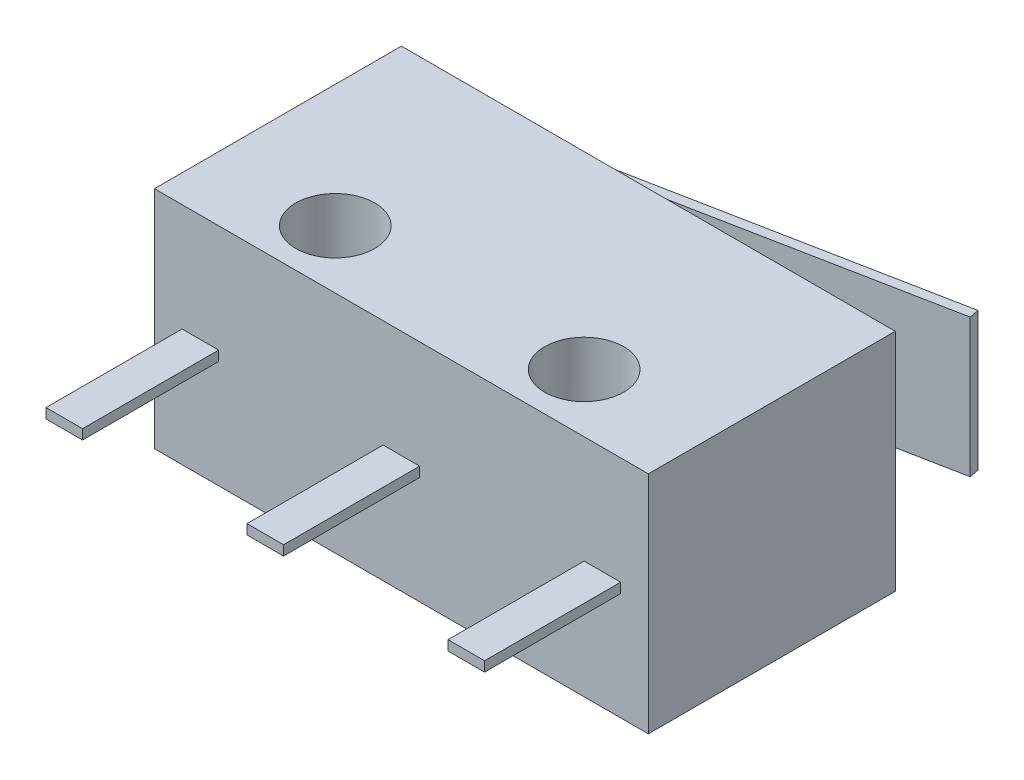
ISO-10303-21;
HEADER;
FILE_DESCRIPTION(('STEP AP214'),'2;1');
FILE_NAME('part.step','',(''),(''),'','','');
FILE_SCHEMA(('AUTOMOTIVE_DESIGN { 1 0 10303 214 1 1 1 1 }'));
ENDSEC;
DATA;
#1=APPLICATION_CONTEXT('core data for automotive mechanical design processes');
#2=APPLICATION_PROTOCOL_DEFINITION('international standard','automotive_design',2000,#1);
#3=PRODUCT_CONTEXT('',#1,'mechanical');
#4=PRODUCT('Part','Part','',(#3));
#5=PRODUCT_RELATED_PRODUCT_CATEGORY('part','',(#4));
#6=PRODUCT_DEFINITION_FORMATION('','',#4);
#7=PRODUCT_DEFINITION_CONTEXT('part definition',#1,'design');
#8=PRODUCT_DEFINITION('design','',#6,#7);
#9=PRODUCT_DEFINITION_SHAPE('','',#8);
#10=(LENGTH_UNIT() NAMED_UNIT(*) SI_UNIT(.MILLI.,.METRE.));
#11=(NAMED_UNIT(*) PLANE_ANGLE_UNIT() SI_UNIT($,.RADIAN.));
#12=(NAMED_UNIT(*) SI_UNIT($,.STERADIAN.) SOLID_ANGLE_UNIT());
#13=UNCERTAINTY_MEASURE_WITH_UNIT(LENGTH_MEASURE(1.E-05),#10,'distance_accuracy_value','');
#14=(GEOMETRIC_REPRESENTATION_CONTEXT(3) GLOBAL_UNCERTAINTY_ASSIGNED_CONTEXT((#13)) GLOBAL_UNIT_ASSIGNED_CONTEXT((#10,
#11,#12)) REPRESENTATION_CONTEXT('',''));
#15=CARTESIAN_POINT('',(0.,0.,0.));
#16=DIRECTION('',(0.,0.,1.));
#17=DIRECTION('',(1.,0.,0.));
#18=AXIS2_PLACEMENT_3D('',#15,#16,#17);
#19=CARTESIAN_POINT('',(-6.39884615384615,4.6736,-3.42425900837169));
#20=DIRECTION('',(0.981334678628698,0.,-0.192307692307692));
#21=DIRECTION('',(-0.192307692307692,0.,-0.981334678628698));
#22=AXIS2_PLACEMENT_3D('',#19,#20,#21);
#23=PLANE('',#22);
#24=DIRECTION('',(0.,1.,0.));
#25=VECTOR('',#24,1.);
#26=CARTESIAN_POINT('',(-6.35,4.6736,-3.175));
#27=LINE('',#26,#25);
#28=CARTESIAN_POINT('',(-6.35,1.1176,-3.175));
#29=VERTEX_POINT('',#28);
#30=CARTESIAN_POINT('',(-6.35,4.6736,-3.175));
#31=VERTEX_POINT('',#30);
#32=EDGE_CURVE('E108',#29,#31,#27,.T.);
#33=ORIENTED_EDGE('',*,*,#32,.T.);
#34=DIRECTION('',(0.192307692307692,0.,0.981334678628698));
#35=VECTOR('',#34,1.);
#36=CARTESIAN_POINT('',(-6.39884615384615,4.6736,-3.42425900837169));
#37=LINE('',#36,#35);
#38=CARTESIAN_POINT('',(-6.39884615384615,4.6736,-3.42425900837169));
#39=VERTEX_POINT('',#38);
#40=EDGE_CURVE('E12',#39,#31,#37,.T.);
#41=ORIENTED_EDGE('',*,*,#40,.F.);
#42=DIRECTION('',(0.,1.,0.));
#43=VECTOR('',#42,1.);
#44=CARTESIAN_POINT('',(-6.39884615384615,4.6736,-3.42425900837169));
#45=LINE('',#44,#43);
#46=CARTESIAN_POINT('',(-6.39884615384616,1.1176,-3.42425900837169));
#47=VERTEX_POINT('',#46);
#48=EDGE_CURVE('E96',#47,#39,#45,.T.);
#49=ORIENTED_EDGE('',*,*,#48,.F.);
#50=DIRECTION('',(0.192307692307692,0.,0.981334678628698));
#51=VECTOR('',#50,1.);
#52=CARTESIAN_POINT('',(-6.39884615384616,1.1176,-3.42425900837169));
#53=LINE('',#52,#51);
#54=EDGE_CURVE('E104',#47,#29,#53,.T.);
#55=ORIENTED_EDGE('',*,*,#54,.T.);
#56=EDGE_LOOP('',(#33,#41,#49,#55));
#57=FACE_BOUND('',#56,.T.);
#58=ADVANCED_FACE('F45',(#57),#23,.F.);
#59=CARTESIAN_POINT('',(-6.39884615384615,4.6736,-3.42425900837169));
#60=DIRECTION('',(0.,-1.,0.));
#61=DIRECTION('',(1.,0.,0.));
#62=AXIS2_PLACEMENT_3D('',#59,#60,#61);
#63=PLANE('',#62);
#64=DIRECTION('',(0.981334678628698,0.,-0.192307692307692));
#65=VECTOR('',#64,1.);
#66=CARTESIAN_POINT('',(-6.35,4.6736,-3.175));
#67=LINE('',#66,#65);
#68=CARTESIAN_POINT('',(5.88032544378698,4.6736,-5.57172123434316));
#69=VERTEX_POINT('',#68);
#70=EDGE_CURVE('E100',#31,#69,#67,.T.);
#71=ORIENTED_EDGE('',*,*,#70,.T.);
#72=DIRECTION('',(0.192307692307692,0.,0.981334678628698));
#73=VECTOR('',#72,1.);
#74=CARTESIAN_POINT('',(5.83147928994083,4.6736,-5.82098024271485));
#75=LINE('',#74,#73);
#76=CARTESIAN_POINT('',(5.83147928994083,4.6736,-5.82098024271485));
#77=VERTEX_POINT('',#76);
#78=EDGE_CURVE('E53',#77,#69,#75,.T.);
#79=ORIENTED_EDGE('',*,*,#78,.F.);
#80=DIRECTION('',(0.981334678628698,0.,-0.192307692307692));
#81=VECTOR('',#80,1.);
#82=CARTESIAN_POINT('',(-6.39884615384615,4.6736,-3.42425900837169));
#83=LINE('',#82,#81);
#84=EDGE_CURVE('E91',#39,#77,#83,.T.);
#85=ORIENTED_EDGE('',*,*,#84,.F.);
#86=ORIENTED_EDGE('',*,*,#40,.T.);
#87=EDGE_LOOP('',(#71,#79,#85,#86));
#88=FACE_BOUND('',#87,.T.);
#89=ADVANCED_FACE('F99',(#88),#63,.F.);
#90=CARTESIAN_POINT('',(5.83147928994083,4.6736,-5.82098024271485));
#91=DIRECTION('',(-0.981334678628698,0.,0.192307692307692));
#92=DIRECTION('',(0.192307692307692,0.,0.981334678628698));
#93=AXIS2_PLACEMENT_3D('',#90,#91,#92);
#94=PLANE('',#93);
#95=DIRECTION('',(0.,-1.,0.));
#96=VECTOR('',#95,1.);
#97=CARTESIAN_POINT('',(5.88032544378698,4.6736,-5.57172123434316));
#98=LINE('',#97,#96);
#99=CARTESIAN_POINT('',(5.88032544378698,1.1176,-5.57172123434316));
#100=VERTEX_POINT('',#99);
#101=EDGE_CURVE('E78',#69,#100,#98,.T.);
#102=ORIENTED_EDGE('',*,*,#101,.T.);
#103=DIRECTION('',(0.192307692307692,0.,0.981334678628698));
#104=VECTOR('',#103,1.);
#105=CARTESIAN_POINT('',(5.83147928994083,1.1176,-5.82098024271485));
#106=LINE('',#105,#104);
#107=CARTESIAN_POINT('',(5.83147928994083,1.1176,-5.82098024271485));
#108=VERTEX_POINT('',#107);
#109=EDGE_CURVE('E101',#108,#100,#106,.T.);
#110=ORIENTED_EDGE('',*,*,#109,.F.);
#111=DIRECTION('',(0.,-1.,0.));
#112=VECTOR('',#111,1.);
#113=CARTESIAN_POINT('',(5.83147928994083,4.6736,-5.82098024271485));
#114=LINE('',#113,#112);
#115=EDGE_CURVE('E94',#77,#108,#114,.T.);
#116=ORIENTED_EDGE('',*,*,#115,.F.);
#117=ORIENTED_EDGE('',*,*,#78,.T.);
#118=EDGE_LOOP('',(#102,#110,#116,#117));
#119=FACE_BOUND('',#118,.T.);
#120=ADVANCED_FACE('F102',(#119),#94,.F.);
#121=CARTESIAN_POINT('',(-6.39884615384616,1.1176,-3.42425900837169));
#122=DIRECTION('',(0.,1.,0.));
#123=DIRECTION('',(-1.,0.,0.));
#124=AXIS2_PLACEMENT_3D('',#121,#122,#123);
#125=PLANE('',#124);
#126=DIRECTION('',(-0.981334678628698,0.,0.192307692307692));
#127=VECTOR('',#126,1.);
#128=CARTESIAN_POINT('',(-6.35,1.1176,-3.175));
#129=LINE('',#128,#127);
#130=EDGE_CURVE('E84',#100,#29,#129,.T.);
#131=ORIENTED_EDGE('',*,*,#130,.T.);
#132=ORIENTED_EDGE('',*,*,#54,.F.);
#133=DIRECTION('',(-0.981334678628698,0.,0.192307692307692));
#134=VECTOR('',#133,1.);
#135=CARTESIAN_POINT('',(-6.39884615384616,1.1176,-3.42425900837169));
#136=LINE('',#135,#134);
#137=EDGE_CURVE('E61',#108,#47,#136,.T.);
#138=ORIENTED_EDGE('',*,*,#137,.F.);
#139=ORIENTED_EDGE('',*,*,#109,.T.);
#140=EDGE_LOOP('',(#131,#132,#138,#139));
#141=FACE_BOUND('',#140,.T.);
#142=ADVANCED_FACE('F115',(#141),#125,.F.);
#143=CARTESIAN_POINT('',(-0.882863740538454,0.,-4.50520098649002));
#144=DIRECTION('',(0.192307692307692,0.,0.981334678628698));
#145=DIRECTION('',(0.981334678628698,0.,-0.192307692307692));
#146=AXIS2_PLACEMENT_3D('',#143,#144,#145);
#147=PLANE('',#146);
#148=ORIENTED_EDGE('',*,*,#48,.T.);
#149=ORIENTED_EDGE('',*,*,#84,.T.);
#150=ORIENTED_EDGE('',*,*,#115,.T.);
#151=ORIENTED_EDGE('',*,*,#137,.T.);
#152=EDGE_LOOP('',(#148,#149,#150,#151));
#153=FACE_BOUND('',#152,.T.);
#154=ADVANCED_FACE('F92',(#153),#147,.F.);
#155=CARTESIAN_POINT('',(-0.8340175866923,0.,-4.25594197811833));
#156=DIRECTION('',(0.192307692307692,0.,0.981334678628698));
#157=DIRECTION('',(0.981334678628698,0.,-0.192307692307692));
#158=AXIS2_PLACEMENT_3D('',#155,#156,#157);
#159=PLANE('',#158);
#160=ORIENTED_EDGE('',*,*,#32,.F.);
#161=ORIENTED_EDGE('',*,*,#130,.F.);
#162=ORIENTED_EDGE('',*,*,#101,.F.);
#163=ORIENTED_EDGE('',*,*,#70,.F.);
#164=EDGE_LOOP('',(#160,#161,#162,#163));
#165=FACE_BOUND('',#164,.T.);
#166=ADVANCED_FACE('F118',(#165),#159,.T.);
#167=CLOSED_SHELL('',(#58,#89,#120,#142,#154,#166));
#168=MANIFOLD_SOLID_BREP('B2',#167);
#169=CARTESIAN_POINT('',(-6.35,5.7912,3.175));
#170=DIRECTION('',(0.,0.,-1.));
#171=DIRECTION('',(-1.,0.,0.));
#172=AXIS2_PLACEMENT_3D('',#169,#170,#171);
#173=PLANE('',#172);
#174=DIRECTION('',(0.,-1.,0.));
#175=VECTOR('',#174,1.);
#176=CARTESIAN_POINT('',(-0.469900000000001,3.0226,3.175));
#177=LINE('',#176,#175);
#178=CARTESIAN_POINT('',(-0.469900000000001,3.0226,3.175));
#179=VERTEX_POINT('',#178);
#180=CARTESIAN_POINT('',(-0.469900000000001,2.7686,3.175));
#181=VERTEX_POINT('',#180);
#182=EDGE_CURVE('E315',#179,#181,#177,.T.);
#183=ORIENTED_EDGE('',*,*,#182,.F.);
#184=DIRECTION('',(-1.,0.,0.));
#185=VECTOR('',#184,1.);
#186=CARTESIAN_POINT('',(-0.469900000000001,3.0226,3.175));
#187=LINE('',#186,#185);
#188=CARTESIAN_POINT('',(0.4699,3.0226,3.175));
#189=VERTEX_POINT('',#188);
#190=EDGE_CURVE('E328',#189,#179,#187,.T.);
#191=ORIENTED_EDGE('',*,*,#190,.F.);
#192=DIRECTION('',(0.,1.,0.));
#193=VECTOR('',#192,1.);
#194=CARTESIAN_POINT('',(0.469899999999999,3.0226,3.175));
#195=LINE('',#194,#193);
#196=CARTESIAN_POINT('',(0.469899999999999,2.7686,3.175));
#197=VERTEX_POINT('',#196);
#198=EDGE_CURVE('E337',#197,#189,#195,.T.);
#199=ORIENTED_EDGE('',*,*,#198,.F.);
#200=DIRECTION('',(1.,0.,0.));
#201=VECTOR('',#200,1.);
#202=CARTESIAN_POINT('',(-0.469900000000001,2.7686,3.175));
#203=LINE('',#202,#201);
#204=EDGE_CURVE('E318',#181,#197,#203,.T.);
#205=ORIENTED_EDGE('',*,*,#204,.F.);
#206=EDGE_LOOP('',(#183,#191,#199,#205));
#207=FACE_BOUND('',#206,.T.);
#208=DIRECTION('',(1.,0.,0.));
#209=VECTOR('',#208,1.);
#210=CARTESIAN_POINT('',(-6.35,0.,3.175));
#211=LINE('',#210,#209);
#212=CARTESIAN_POINT('',(-6.35,0.,3.175));
#213=VERTEX_POINT('',#212);
#214=CARTESIAN_POINT('',(6.35,0.,3.175));
#215=VERTEX_POINT('',#214);
#216=EDGE_CURVE('E419',#213,#215,#211,.T.);
#217=ORIENTED_EDGE('',*,*,#216,.T.);
#218=DIRECTION('',(0.,-1.,0.));
#219=VECTOR('',#218,1.);
#220=CARTESIAN_POINT('',(6.35,5.7912,3.175));
#221=LINE('',#220,#219);
#222=CARTESIAN_POINT('',(6.35,5.7912,3.175));
#223=VERTEX_POINT('',#222);
#224=EDGE_CURVE('E425',#223,#215,#221,.T.);
#225=ORIENTED_EDGE('',*,*,#224,.F.);
#226=DIRECTION('',(1.,0.,0.));
#227=VECTOR('',#226,1.);
#228=CARTESIAN_POINT('',(-6.35,5.7912,3.175));
#229=LINE('',#228,#227);
#230=CARTESIAN_POINT('',(-6.35,5.7912,3.175));
#231=VERTEX_POINT('',#230);
#232=EDGE_CURVE('E423',#231,#223,#229,.T.);
#233=ORIENTED_EDGE('',*,*,#232,.F.);
#234=DIRECTION('',(0.,-1.,0.));
#235=VECTOR('',#234,1.);
#236=CARTESIAN_POINT('',(-6.35,5.7912,3.175));
#237=LINE('',#236,#235);
#238=EDGE_CURVE('E436',#231,#213,#237,.T.);
#239=ORIENTED_EDGE('',*,*,#238,.T.);
#240=EDGE_LOOP('',(#217,#225,#233,#239));
#241=FACE_BOUND('',#240,.T.);
#242=DIRECTION('',(0.,-1.,0.));
#243=VECTOR('',#242,1.);
#244=CARTESIAN_POINT('',(-5.6388,3.0226,3.175));
#245=LINE('',#244,#243);
#246=CARTESIAN_POINT('',(-5.6388,3.0226,3.175));
#247=VERTEX_POINT('',#246);
#248=CARTESIAN_POINT('',(-5.6388,2.7686,3.175));
#249=VERTEX_POINT('',#248);
#250=EDGE_CURVE('E353',#247,#249,#245,.T.);
#251=ORIENTED_EDGE('',*,*,#250,.F.);
#252=DIRECTION('',(-1.,0.,0.));
#253=VECTOR('',#252,1.);
#254=CARTESIAN_POINT('',(-5.6388,3.0226,3.175));
#255=LINE('',#254,#253);
#256=CARTESIAN_POINT('',(-4.699,3.0226,3.175));
#257=VERTEX_POINT('',#256);
#258=EDGE_CURVE('E358',#257,#247,#255,.T.);
#259=ORIENTED_EDGE('',*,*,#258,.F.);
#260=DIRECTION('',(0.,1.,0.));
#261=VECTOR('',#260,1.);
#262=CARTESIAN_POINT('',(-4.699,3.0226,3.175));
#263=LINE('',#262,#261);
#264=CARTESIAN_POINT('',(-4.699,2.7686,3.175));
#265=VERTEX_POINT('',#264);
#266=EDGE_CURVE('E370',#265,#257,#263,.T.);
#267=ORIENTED_EDGE('',*,*,#266,.F.);
#268=DIRECTION('',(1.,0.,0.));
#269=VECTOR('',#268,1.);
#270=CARTESIAN_POINT('',(-5.6388,2.7686,3.175));
#271=LINE('',#270,#269);
#272=EDGE_CURVE('E367',#249,#265,#271,.T.);
#273=ORIENTED_EDGE('',*,*,#272,.F.);
#274=EDGE_LOOP('',(#251,#259,#267,#273));
#275=FACE_BOUND('',#274,.T.);
#276=DIRECTION('',(0.,-1.,0.));
#277=VECTOR('',#276,1.);
#278=CARTESIAN_POINT('',(4.699,3.0226,3.175));
#279=LINE('',#278,#277);
#280=CARTESIAN_POINT('',(4.699,3.0226,3.175));
#281=VERTEX_POINT('',#280);
#282=CARTESIAN_POINT('',(4.699,2.7686,3.175));
#283=VERTEX_POINT('',#282);
#284=EDGE_CURVE('E314',#281,#283,#279,.T.);
#285=ORIENTED_EDGE('',*,*,#284,.F.);
#286=DIRECTION('',(-1.,0.,0.));
#287=VECTOR('',#286,1.);
#288=CARTESIAN_POINT('',(4.699,3.0226,3.175));
#289=LINE('',#288,#287);
#290=CARTESIAN_POINT('',(5.6388,3.0226,3.175));
#291=VERTEX_POINT('',#290);
#292=EDGE_CURVE('E311',#291,#281,#289,.T.);
#293=ORIENTED_EDGE('',*,*,#292,.F.);
#294=DIRECTION('',(0.,1.,0.));
#295=VECTOR('',#294,1.);
#296=CARTESIAN_POINT('',(5.6388,3.0226,3.175));
#297=LINE('',#296,#295);
#298=CARTESIAN_POINT('',(5.6388,2.7686,3.175));
#299=VERTEX_POINT('',#298);
#300=EDGE_CURVE('E189',#299,#291,#297,.T.);
#301=ORIENTED_EDGE('',*,*,#300,.F.);
#302=DIRECTION('',(1.,0.,0.));
#303=VECTOR('',#302,1.);
#304=CARTESIAN_POINT('',(4.699,2.7686,3.175));
#305=LINE('',#304,#303);
#306=EDGE_CURVE('E184',#283,#299,#305,.T.);
#307=ORIENTED_EDGE('',*,*,#306,.F.);
#308=EDGE_LOOP('',(#285,#293,#301,#307));
#309=FACE_BOUND('',#308,.T.);
#310=ADVANCED_FACE('F169',(#207,#241,#275,#309),#173,.F.);
#311=CARTESIAN_POINT('',(-6.35,5.7912,-3.175));
#312=DIRECTION('',(0.,0.,1.));
#313=DIRECTION('',(1.,0.,0.));
#314=AXIS2_PLACEMENT_3D('',#311,#312,#313);
#315=PLANE('',#314);
#316=DIRECTION('',(-1.,0.,0.));
#317=VECTOR('',#316,1.);
#318=CARTESIAN_POINT('',(-6.35,0.,-3.175));
#319=LINE('',#318,#317);
#320=CARTESIAN_POINT('',(6.35,0.,-3.175));
#321=VERTEX_POINT('',#320);
#322=CARTESIAN_POINT('',(-6.35,0.,-3.175));
#323=VERTEX_POINT('',#322);
#324=EDGE_CURVE('E428',#321,#323,#319,.T.);
#325=ORIENTED_EDGE('',*,*,#324,.T.);
#326=DIRECTION('',(0.,-1.,0.));
#327=VECTOR('',#326,1.);
#328=CARTESIAN_POINT('',(-6.35,5.7912,-3.175));
#329=LINE('',#328,#327);
#330=CARTESIAN_POINT('',(-6.35,5.7912,-3.175));
#331=VERTEX_POINT('',#330);
#332=EDGE_CURVE('E177',#331,#323,#329,.T.);
#333=ORIENTED_EDGE('',*,*,#332,.F.);
#334=DIRECTION('',(-1.,0.,0.));
#335=VECTOR('',#334,1.);
#336=CARTESIAN_POINT('',(-6.35,5.7912,-3.175));
#337=LINE('',#336,#335);
#338=CARTESIAN_POINT('',(6.35,5.7912,-3.175));
#339=VERTEX_POINT('',#338);
#340=EDGE_CURVE('E418',#339,#331,#337,.T.);
#341=ORIENTED_EDGE('',*,*,#340,.F.);
#342=DIRECTION('',(0.,-1.,0.));
#343=VECTOR('',#342,1.);
#344=CARTESIAN_POINT('',(6.35,5.7912,-3.175));
#345=LINE('',#344,#343);
#346=EDGE_CURVE('E43',#339,#321,#345,.T.);
#347=ORIENTED_EDGE('',*,*,#346,.T.);
#348=EDGE_LOOP('',(#325,#333,#341,#347));
#349=FACE_BOUND('',#348,.T.);
#350=DIRECTION('',(0.,1.,0.));
#351=VECTOR('',#350,1.);
#352=CARTESIAN_POINT('',(-1.6256,-0.58628379885484,-3.175));
#353=LINE('',#352,#351);
#354=CARTESIAN_POINT('',(-1.6256,1.1176,-3.175));
#355=VERTEX_POINT('',#354);
#356=CARTESIAN_POINT('',(-1.6256,4.6736,-3.175));
#357=VERTEX_POINT('',#356);
#358=EDGE_CURVE('E397',#355,#357,#353,.T.);
#359=ORIENTED_EDGE('',*,*,#358,.T.);
#360=DIRECTION('',(1.,0.,0.));
#361=VECTOR('',#360,1.);
#362=CARTESIAN_POINT('',(-3.1496,4.6736,-3.175));
#363=LINE('',#362,#361);
#364=CARTESIAN_POINT('',(-3.1496,4.6736,-3.175));
#365=VERTEX_POINT('',#364);
#366=EDGE_CURVE('E387',#365,#357,#363,.T.);
#367=ORIENTED_EDGE('',*,*,#366,.F.);
#368=DIRECTION('',(0.,1.,0.));
#369=VECTOR('',#368,1.);
#370=CARTESIAN_POINT('',(-3.1496,-0.58628379885484,-3.175));
#371=LINE('',#370,#369);
#372=CARTESIAN_POINT('',(-3.1496,1.1176,-3.175));
#373=VERTEX_POINT('',#372);
#374=EDGE_CURVE('E394',#373,#365,#371,.T.);
#375=ORIENTED_EDGE('',*,*,#374,.F.);
#376=DIRECTION('',(1.,0.,0.));
#377=VECTOR('',#376,1.);
#378=CARTESIAN_POINT('',(-3.1496,1.1176,-3.175));
#379=LINE('',#378,#377);
#380=EDGE_CURVE('E390',#373,#355,#379,.T.);
#381=ORIENTED_EDGE('',*,*,#380,.T.);
#382=EDGE_LOOP('',(#359,#367,#375,#381));
#383=FACE_BOUND('',#382,.T.);
#384=ADVANCED_FACE('F445',(#349,#383),#315,.F.);
#385=CARTESIAN_POINT('',(6.35,5.7912,3.175));
#386=DIRECTION('',(-1.,0.,0.));
#387=DIRECTION('',(0.,0.,1.));
#388=AXIS2_PLACEMENT_3D('',#385,#386,#387);
#389=PLANE('',#388);
#390=DIRECTION('',(0.,0.,-1.));
#391=VECTOR('',#390,1.);
#392=CARTESIAN_POINT('',(6.35,0.,3.175));
#393=LINE('',#392,#391);
#394=EDGE_CURVE('E414',#215,#321,#393,.T.);
#395=ORIENTED_EDGE('',*,*,#394,.T.);
#396=ORIENTED_EDGE('',*,*,#346,.F.);
#397=DIRECTION('',(0.,0.,-1.));
#398=VECTOR('',#397,1.);
#399=CARTESIAN_POINT('',(6.35,5.7912,3.175));
#400=LINE('',#399,#398);
#401=EDGE_CURVE('E415',#223,#339,#400,.T.);
#402=ORIENTED_EDGE('',*,*,#401,.F.);
#403=ORIENTED_EDGE('',*,*,#224,.T.);
#404=EDGE_LOOP('',(#395,#396,#402,#403));
#405=FACE_BOUND('',#404,.T.);
#406=ADVANCED_FACE('F171',(#405),#389,.F.);
#407=CARTESIAN_POINT('',(-6.35,5.7912,3.175));
#408=DIRECTION('',(1.,0.,0.));
#409=DIRECTION('',(0.,0.,-1.));
#410=AXIS2_PLACEMENT_3D('',#407,#408,#409);
#411=PLANE('',#410);
#412=DIRECTION('',(0.,0.,1.));
#413=VECTOR('',#412,1.);
#414=CARTESIAN_POINT('',(-6.35,0.,3.175));
#415=LINE('',#414,#413);
#416=EDGE_CURVE('E431',#323,#213,#415,.T.);
#417=ORIENTED_EDGE('',*,*,#416,.T.);
#418=ORIENTED_EDGE('',*,*,#238,.F.);
#419=DIRECTION('',(0.,0.,1.));
#420=VECTOR('',#419,1.);
#421=CARTESIAN_POINT('',(-6.35,5.7912,3.175));
#422=LINE('',#421,#420);
#423=EDGE_CURVE('E421',#331,#231,#422,.T.);
#424=ORIENTED_EDGE('',*,*,#423,.F.);
#425=ORIENTED_EDGE('',*,*,#332,.T.);
#426=EDGE_LOOP('',(#417,#418,#424,#425));
#427=FACE_BOUND('',#426,.T.);
#428=ADVANCED_FACE('F441',(#427),#411,.F.);
#429=CARTESIAN_POINT('',(0.,5.7912,0.));
#430=DIRECTION('',(0.,-1.,0.));
#431=DIRECTION('',(0.,0.,-1.));
#432=AXIS2_PLACEMENT_3D('',#429,#430,#431);
#433=PLANE('',#432);
#434=CARTESIAN_POINT('',(-3.2,5.7912,1.675));
#435=DIRECTION('',(0.,1.,0.));
#436=DIRECTION('',(0.,0.,-1.));
#437=AXIS2_PLACEMENT_3D('',#434,#435,#436);
#438=CIRCLE('',#437,1.016);
#439=CARTESIAN_POINT('',(-3.2,5.7912,0.658999999999999));
#440=VERTEX_POINT('',#439);
#441=EDGE_CURVE('E393',#440,#440,#438,.T.);
#442=ORIENTED_EDGE('',*,*,#441,.F.);
#443=EDGE_LOOP('',(#442));
#444=FACE_BOUND('',#443,.T.);
#445=CARTESIAN_POINT('',(3.2,5.7912,1.675));
#446=DIRECTION('',(0.,1.,0.));
#447=DIRECTION('',(0.,0.,1.));
#448=AXIS2_PLACEMENT_3D('',#445,#446,#447);
#449=CIRCLE('',#448,1.016);
#450=CARTESIAN_POINT('',(3.2,5.7912,2.691));
#451=VERTEX_POINT('',#450);
#452=EDGE_CURVE('E408',#451,#451,#449,.T.);
#453=ORIENTED_EDGE('',*,*,#452,.F.);
#454=EDGE_LOOP('',(#453));
#455=FACE_BOUND('',#454,.T.);
#456=ORIENTED_EDGE('',*,*,#401,.T.);
#457=ORIENTED_EDGE('',*,*,#340,.T.);
#458=ORIENTED_EDGE('',*,*,#423,.T.);
#459=ORIENTED_EDGE('',*,*,#232,.T.);
#460=EDGE_LOOP('',(#456,#457,#458,#459));
#461=FACE_BOUND('',#460,.T.);
#462=ADVANCED_FACE('F459',(#444,#455,#461),#433,.F.);
#463=CARTESIAN_POINT('',(0.,0.,0.));
#464=DIRECTION('',(0.,-1.,0.));
#465=DIRECTION('',(0.,0.,-1.));
#466=AXIS2_PLACEMENT_3D('',#463,#464,#465);
#467=PLANE('',#466);
#468=CARTESIAN_POINT('',(-3.2,0.,1.675));
#469=DIRECTION('',(0.,-1.,0.));
#470=DIRECTION('',(0.,0.,-1.));
#471=AXIS2_PLACEMENT_3D('',#468,#469,#470);
#472=CIRCLE('',#471,1.016);
#473=CARTESIAN_POINT('',(-3.2,0.,0.658999999999999));
#474=VERTEX_POINT('',#473);
#475=EDGE_CURVE('E405',#474,#474,#472,.F.);
#476=ORIENTED_EDGE('',*,*,#475,.T.);
#477=EDGE_LOOP('',(#476));
#478=FACE_BOUND('',#477,.T.);
#479=CARTESIAN_POINT('',(3.2,0.,1.675));
#480=DIRECTION('',(0.,-1.,0.));
#481=DIRECTION('',(0.,0.,-1.));
#482=AXIS2_PLACEMENT_3D('',#479,#480,#481);
#483=CIRCLE('',#482,1.016);
#484=CARTESIAN_POINT('',(3.2,0.,0.658999999999999));
#485=VERTEX_POINT('',#484);
#486=EDGE_CURVE('E411',#485,#485,#483,.F.);
#487=ORIENTED_EDGE('',*,*,#486,.T.);
#488=EDGE_LOOP('',(#487));
#489=FACE_BOUND('',#488,.T.);
#490=ORIENTED_EDGE('',*,*,#394,.F.);
#491=ORIENTED_EDGE('',*,*,#216,.F.);
#492=ORIENTED_EDGE('',*,*,#416,.F.);
#493=ORIENTED_EDGE('',*,*,#324,.F.);
#494=EDGE_LOOP('',(#490,#491,#492,#493));
#495=FACE_BOUND('',#494,.T.);
#496=ADVANCED_FACE('F451',(#478,#489,#495),#467,.T.);
#497=CARTESIAN_POINT('',(3.2,-2.87368195874213,1.675));
#498=DIRECTION('',(0.,1.,0.));
#499=DIRECTION('',(0.,0.,1.));
#500=AXIS2_PLACEMENT_3D('',#497,#498,#499);
#501=CYLINDRICAL_SURFACE('',#500,1.016);
#502=ORIENTED_EDGE('',*,*,#452,.T.);
#503=EDGE_LOOP('',(#502));
#504=FACE_BOUND('',#503,.T.);
#505=ORIENTED_EDGE('',*,*,#486,.F.);
#506=EDGE_LOOP('',(#505));
#507=FACE_BOUND('',#506,.T.);
#508=ADVANCED_FACE('F467',(#504,#507),#501,.F.);
#509=CARTESIAN_POINT('',(-3.2,-2.87368195874213,1.675));
#510=DIRECTION('',(0.,1.,0.));
#511=DIRECTION('',(0.,0.,1.));
#512=AXIS2_PLACEMENT_3D('',#509,#510,#511);
#513=CYLINDRICAL_SURFACE('',#512,1.016);
#514=ORIENTED_EDGE('',*,*,#441,.T.);
#515=EDGE_LOOP('',(#514));
#516=FACE_BOUND('',#515,.T.);
#517=ORIENTED_EDGE('',*,*,#475,.F.);
#518=EDGE_LOOP('',(#517));
#519=FACE_BOUND('',#518,.T.);
#520=ADVANCED_FACE('F538',(#516,#519),#513,.F.);
#521=CARTESIAN_POINT('',(0.,1.1176,0.));
#522=DIRECTION('',(0.,-1.,0.));
#523=DIRECTION('',(0.,0.,-1.));
#524=AXIS2_PLACEMENT_3D('',#521,#522,#523);
#525=PLANE('',#524);
#526=ORIENTED_EDGE('',*,*,#380,.F.);
#527=CARTESIAN_POINT('',(-2.3876,1.1176,-3.175));
#528=DIRECTION('',(0.,-1.,0.));
#529=DIRECTION('',(0.,0.,-1.));
#530=AXIS2_PLACEMENT_3D('',#527,#528,#529);
#531=CIRCLE('',#530,0.762);
#532=EDGE_CURVE('E386',#373,#355,#531,.T.);
#533=ORIENTED_EDGE('',*,*,#532,.T.);
#534=EDGE_LOOP('',(#526,#533));
#535=FACE_BOUND('',#534,.T.);
#536=ADVANCED_FACE('F531',(#535),#525,.T.);
#537=CARTESIAN_POINT('',(-2.3876,4.6736,-3.175));
#538=DIRECTION('',(0.,-1.,0.));
#539=DIRECTION('',(0.,0.,-1.));
#540=AXIS2_PLACEMENT_3D('',#537,#538,#539);
#541=PLANE('',#540);
#542=CARTESIAN_POINT('',(-2.3876,4.6736,-3.175));
#543=DIRECTION('',(0.,-1.,0.));
#544=DIRECTION('',(0.,0.,-1.));
#545=AXIS2_PLACEMENT_3D('',#542,#543,#544);
#546=CIRCLE('',#545,0.762);
#547=EDGE_CURVE('E391',#365,#357,#546,.T.);
#548=ORIENTED_EDGE('',*,*,#547,.F.);
#549=ORIENTED_EDGE('',*,*,#366,.T.);
#550=EDGE_LOOP('',(#548,#549));
#551=FACE_BOUND('',#550,.T.);
#552=ADVANCED_FACE('F528',(#551),#541,.F.);
#553=CARTESIAN_POINT('',(-2.3876,-0.58628379885484,-3.175));
#554=DIRECTION('',(0.,1.,0.));
#555=DIRECTION('',(0.,0.,1.));
#556=AXIS2_PLACEMENT_3D('',#553,#554,#555);
#557=CYLINDRICAL_SURFACE('',#556,0.762);
#558=ORIENTED_EDGE('',*,*,#358,.F.);
#559=ORIENTED_EDGE('',*,*,#532,.F.);
#560=ORIENTED_EDGE('',*,*,#374,.T.);
#561=ORIENTED_EDGE('',*,*,#547,.T.);
#562=EDGE_LOOP('',(#558,#559,#560,#561));
#563=FACE_BOUND('',#562,.T.);
#564=ADVANCED_FACE('F526',(#563),#557,.T.);
#565=CARTESIAN_POINT('',(-5.6388,3.0226,6.675));
#566=DIRECTION('',(1.,0.,0.));
#567=DIRECTION('',(0.,0.,-1.));
#568=AXIS2_PLACEMENT_3D('',#565,#566,#567);
#569=PLANE('',#568);
#570=ORIENTED_EDGE('',*,*,#250,.T.);
#571=DIRECTION('',(0.,0.,-1.));
#572=VECTOR('',#571,1.);
#573=CARTESIAN_POINT('',(-5.6388,2.7686,6.675));
#574=LINE('',#573,#572);
#575=CARTESIAN_POINT('',(-5.6388,2.7686,6.675));
#576=VERTEX_POINT('',#575);
#577=EDGE_CURVE('E383',#576,#249,#574,.T.);
#578=ORIENTED_EDGE('',*,*,#577,.F.);
#579=DIRECTION('',(0.,-1.,0.));
#580=VECTOR('',#579,1.);
#581=CARTESIAN_POINT('',(-5.6388,3.0226,6.675));
#582=LINE('',#581,#580);
#583=CARTESIAN_POINT('',(-5.6388,3.0226,6.675));
#584=VERTEX_POINT('',#583);
#585=EDGE_CURVE('E354',#584,#576,#582,.T.);
#586=ORIENTED_EDGE('',*,*,#585,.F.);
#587=DIRECTION('',(0.,0.,-1.));
#588=VECTOR('',#587,1.);
#589=CARTESIAN_POINT('',(-5.6388,3.0226,6.675));
#590=LINE('',#589,#588);
#591=EDGE_CURVE('E364',#584,#247,#590,.T.);
#592=ORIENTED_EDGE('',*,*,#591,.T.);
#593=EDGE_LOOP('',(#570,#578,#586,#592));
#594=FACE_BOUND('',#593,.T.);
#595=ADVANCED_FACE('F522',(#594),#569,.F.);
#596=CARTESIAN_POINT('',(-5.6388,2.7686,6.675));
#597=DIRECTION('',(0.,1.,0.));
#598=DIRECTION('',(0.,0.,1.));
#599=AXIS2_PLACEMENT_3D('',#596,#597,#598);
#600=PLANE('',#599);
#601=ORIENTED_EDGE('',*,*,#272,.T.);
#602=DIRECTION('',(0.,0.,-1.));
#603=VECTOR('',#602,1.);
#604=CARTESIAN_POINT('',(-4.699,2.7686,6.675));
#605=LINE('',#604,#603);
#606=CARTESIAN_POINT('',(-4.699,2.7686,6.675));
#607=VERTEX_POINT('',#606);
#608=EDGE_CURVE('E380',#607,#265,#605,.T.);
#609=ORIENTED_EDGE('',*,*,#608,.F.);
#610=DIRECTION('',(1.,0.,0.));
#611=VECTOR('',#610,1.);
#612=CARTESIAN_POINT('',(-5.6388,2.7686,6.675));
#613=LINE('',#612,#611);
#614=EDGE_CURVE('E357',#576,#607,#613,.T.);
#615=ORIENTED_EDGE('',*,*,#614,.F.);
#616=ORIENTED_EDGE('',*,*,#577,.T.);
#617=EDGE_LOOP('',(#601,#609,#615,#616));
#618=FACE_BOUND('',#617,.T.);
#619=ADVANCED_FACE('F518',(#618),#600,.F.);
#620=CARTESIAN_POINT('',(-4.699,3.0226,6.675));
#621=DIRECTION('',(-1.,0.,0.));
#622=DIRECTION('',(0.,0.,1.));
#623=AXIS2_PLACEMENT_3D('',#620,#621,#622);
#624=PLANE('',#623);
#625=ORIENTED_EDGE('',*,*,#266,.T.);
#626=DIRECTION('',(0.,0.,-1.));
#627=VECTOR('',#626,1.);
#628=CARTESIAN_POINT('',(-4.699,3.0226,6.675));
#629=LINE('',#628,#627);
#630=CARTESIAN_POINT('',(-4.699,3.0226,6.675));
#631=VERTEX_POINT('',#630);
#632=EDGE_CURVE('E377',#631,#257,#629,.T.);
#633=ORIENTED_EDGE('',*,*,#632,.F.);
#634=DIRECTION('',(0.,1.,0.));
#635=VECTOR('',#634,1.);
#636=CARTESIAN_POINT('',(-4.699,3.0226,6.675));
#637=LINE('',#636,#635);
#638=EDGE_CURVE('E360',#607,#631,#637,.T.);
#639=ORIENTED_EDGE('',*,*,#638,.F.);
#640=ORIENTED_EDGE('',*,*,#608,.T.);
#641=EDGE_LOOP('',(#625,#633,#639,#640));
#642=FACE_BOUND('',#641,.T.);
#643=ADVANCED_FACE('F514',(#642),#624,.F.);
#644=CARTESIAN_POINT('',(-5.6388,3.0226,6.675));
#645=DIRECTION('',(0.,-1.,0.));
#646=DIRECTION('',(0.,0.,-1.));
#647=AXIS2_PLACEMENT_3D('',#644,#645,#646);
#648=PLANE('',#647);
#649=ORIENTED_EDGE('',*,*,#258,.T.);
#650=ORIENTED_EDGE('',*,*,#591,.F.);
#651=DIRECTION('',(-1.,0.,0.));
#652=VECTOR('',#651,1.);
#653=CARTESIAN_POINT('',(-5.6388,3.0226,6.675));
#654=LINE('',#653,#652);
#655=EDGE_CURVE('E362',#631,#584,#654,.T.);
#656=ORIENTED_EDGE('',*,*,#655,.F.);
#657=ORIENTED_EDGE('',*,*,#632,.T.);
#658=EDGE_LOOP('',(#649,#650,#656,#657));
#659=FACE_BOUND('',#658,.T.);
#660=ADVANCED_FACE('F510',(#659),#648,.F.);
#661=CARTESIAN_POINT('',(0.,0.,6.675));
#662=DIRECTION('',(0.,0.,1.));
#663=DIRECTION('',(1.,0.,0.));
#664=AXIS2_PLACEMENT_3D('',#661,#662,#663);
#665=PLANE('',#664);
#666=ORIENTED_EDGE('',*,*,#585,.T.);
#667=ORIENTED_EDGE('',*,*,#614,.T.);
#668=ORIENTED_EDGE('',*,*,#638,.T.);
#669=ORIENTED_EDGE('',*,*,#655,.T.);
#670=EDGE_LOOP('',(#666,#667,#668,#669));
#671=FACE_BOUND('',#670,.T.);
#672=ADVANCED_FACE('F504',(#671),#665,.T.);
#673=CARTESIAN_POINT('',(-0.469900000000001,3.0226,6.675));
#674=DIRECTION('',(1.,0.,0.));
#675=DIRECTION('',(0.,0.,-1.));
#676=AXIS2_PLACEMENT_3D('',#673,#674,#675);
#677=PLANE('',#676);
#678=ORIENTED_EDGE('',*,*,#182,.T.);
#679=DIRECTION('',(0.,0.,-1.));
#680=VECTOR('',#679,1.);
#681=CARTESIAN_POINT('',(-0.469900000000001,2.7686,6.675));
#682=LINE('',#681,#680);
#683=CARTESIAN_POINT('',(-0.469900000000001,2.7686,6.675));
#684=VERTEX_POINT('',#683);
#685=EDGE_CURVE('E350',#684,#181,#682,.T.);
#686=ORIENTED_EDGE('',*,*,#685,.F.);
#687=DIRECTION('',(0.,-1.,0.));
#688=VECTOR('',#687,1.);
#689=CARTESIAN_POINT('',(-0.469900000000001,3.0226,6.675));
#690=LINE('',#689,#688);
#691=CARTESIAN_POINT('',(-0.469900000000001,3.0226,6.675));
#692=VERTEX_POINT('',#691);
#693=EDGE_CURVE('E324',#692,#684,#690,.T.);
#694=ORIENTED_EDGE('',*,*,#693,.F.);
#695=DIRECTION('',(0.,0.,-1.));
#696=VECTOR('',#695,1.);
#697=CARTESIAN_POINT('',(-0.469900000000001,3.0226,6.675));
#698=LINE('',#697,#696);
#699=EDGE_CURVE('E333',#692,#179,#698,.T.);
#700=ORIENTED_EDGE('',*,*,#699,.T.);
#701=EDGE_LOOP('',(#678,#686,#694,#700));
#702=FACE_BOUND('',#701,.T.);
#703=ADVANCED_FACE('F488',(#702),#677,.F.);
#704=CARTESIAN_POINT('',(-0.469900000000001,2.7686,6.675));
#705=DIRECTION('',(0.,1.,0.));
#706=DIRECTION('',(0.,0.,1.));
#707=AXIS2_PLACEMENT_3D('',#704,#705,#706);
#708=PLANE('',#707);
#709=ORIENTED_EDGE('',*,*,#204,.T.);
#710=DIRECTION('',(0.,0.,-1.));
#711=VECTOR('',#710,1.);
#712=CARTESIAN_POINT('',(0.469899999999999,2.7686,6.675));
#713=LINE('',#712,#711);
#714=CARTESIAN_POINT('',(0.469899999999999,2.7686,6.675));
#715=VERTEX_POINT('',#714);
#716=EDGE_CURVE('E347',#715,#197,#713,.T.);
#717=ORIENTED_EDGE('',*,*,#716,.F.);
#718=DIRECTION('',(1.,0.,0.));
#719=VECTOR('',#718,1.);
#720=CARTESIAN_POINT('',(-0.469900000000001,2.7686,6.675));
#721=LINE('',#720,#719);
#722=EDGE_CURVE('E327',#684,#715,#721,.T.);
#723=ORIENTED_EDGE('',*,*,#722,.F.);
#724=ORIENTED_EDGE('',*,*,#685,.T.);
#725=EDGE_LOOP('',(#709,#717,#723,#724));
#726=FACE_BOUND('',#725,.T.);
#727=ADVANCED_FACE('F496',(#726),#708,.F.);
#728=CARTESIAN_POINT('',(0.469899999999999,3.0226,6.675));
#729=DIRECTION('',(-1.,0.,0.));
#730=DIRECTION('',(0.,0.,1.));
#731=AXIS2_PLACEMENT_3D('',#728,#729,#730);
#732=PLANE('',#731);
#733=ORIENTED_EDGE('',*,*,#198,.T.);
#734=DIRECTION('',(0.,0.,-1.));
#735=VECTOR('',#734,1.);
#736=CARTESIAN_POINT('',(0.469899999999999,3.0226,6.675));
#737=LINE('',#736,#735);
#738=CARTESIAN_POINT('',(0.469899999999999,3.0226,6.675));
#739=VERTEX_POINT('',#738);
#740=EDGE_CURVE('E344',#739,#189,#737,.T.);
#741=ORIENTED_EDGE('',*,*,#740,.F.);
#742=DIRECTION('',(0.,1.,0.));
#743=VECTOR('',#742,1.);
#744=CARTESIAN_POINT('',(0.469899999999999,3.0226,6.675));
#745=LINE('',#744,#743);
#746=EDGE_CURVE('E330',#715,#739,#745,.T.);
#747=ORIENTED_EDGE('',*,*,#746,.F.);
#748=ORIENTED_EDGE('',*,*,#716,.T.);
#749=EDGE_LOOP('',(#733,#741,#747,#748));
#750=FACE_BOUND('',#749,.T.);
#751=ADVANCED_FACE('F494',(#750),#732,.F.);
#752=CARTESIAN_POINT('',(-0.469900000000001,3.0226,6.675));
#753=DIRECTION('',(0.,-1.,0.));
#754=DIRECTION('',(0.,0.,-1.));
#755=AXIS2_PLACEMENT_3D('',#752,#753,#754);
#756=PLANE('',#755);
#757=ORIENTED_EDGE('',*,*,#190,.T.);
#758=ORIENTED_EDGE('',*,*,#699,.F.);
#759=DIRECTION('',(-1.,0.,0.));
#760=VECTOR('',#759,1.);
#761=CARTESIAN_POINT('',(-0.469900000000001,3.0226,6.675));
#762=LINE('',#761,#760);
#763=EDGE_CURVE('E332',#739,#692,#762,.T.);
#764=ORIENTED_EDGE('',*,*,#763,.F.);
#765=ORIENTED_EDGE('',*,*,#740,.T.);
#766=EDGE_LOOP('',(#757,#758,#764,#765));
#767=FACE_BOUND('',#766,.T.);
#768=ADVANCED_FACE('F484',(#767),#756,.F.);
#769=CARTESIAN_POINT('',(0.,0.,6.675));
#770=DIRECTION('',(0.,0.,1.));
#771=DIRECTION('',(1.,0.,0.));
#772=AXIS2_PLACEMENT_3D('',#769,#770,#771);
#773=PLANE('',#772);
#774=ORIENTED_EDGE('',*,*,#693,.T.);
#775=ORIENTED_EDGE('',*,*,#722,.T.);
#776=ORIENTED_EDGE('',*,*,#746,.T.);
#777=ORIENTED_EDGE('',*,*,#763,.T.);
#778=EDGE_LOOP('',(#774,#775,#776,#777));
#779=FACE_BOUND('',#778,.T.);
#780=ADVANCED_FACE('F490',(#779),#773,.T.);
#781=CARTESIAN_POINT('',(4.699,3.0226,6.675));
#782=DIRECTION('',(1.,0.,0.));
#783=DIRECTION('',(0.,0.,-1.));
#784=AXIS2_PLACEMENT_3D('',#781,#782,#783);
#785=PLANE('',#784);
#786=ORIENTED_EDGE('',*,*,#284,.T.);
#787=DIRECTION('',(0.,0.,-1.));
#788=VECTOR('',#787,1.);
#789=CARTESIAN_POINT('',(4.699,2.7686,6.675));
#790=LINE('',#789,#788);
#791=CARTESIAN_POINT('',(4.699,2.7686,6.675));
#792=VERTEX_POINT('',#791);
#793=EDGE_CURVE('E295',#792,#283,#790,.T.);
#794=ORIENTED_EDGE('',*,*,#793,.F.);
#795=DIRECTION('',(0.,-1.,0.));
#796=VECTOR('',#795,1.);
#797=CARTESIAN_POINT('',(4.699,3.0226,6.675));
#798=LINE('',#797,#796);
#799=CARTESIAN_POINT('',(4.699,3.0226,6.675));
#800=VERTEX_POINT('',#799);
#801=EDGE_CURVE('E302',#800,#792,#798,.T.);
#802=ORIENTED_EDGE('',*,*,#801,.F.);
#803=DIRECTION('',(0.,0.,-1.));
#804=VECTOR('',#803,1.);
#805=CARTESIAN_POINT('',(4.699,3.0226,6.675));
#806=LINE('',#805,#804);
#807=EDGE_CURVE('E670',#800,#281,#806,.T.);
#808=ORIENTED_EDGE('',*,*,#807,.T.);
#809=EDGE_LOOP('',(#786,#794,#802,#808));
#810=FACE_BOUND('',#809,.T.);
#811=ADVANCED_FACE('F313',(#810),#785,.F.);
#812=CARTESIAN_POINT('',(4.699,2.7686,6.675));
#813=DIRECTION('',(0.,1.,0.));
#814=DIRECTION('',(0.,0.,1.));
#815=AXIS2_PLACEMENT_3D('',#812,#813,#814);
#816=PLANE('',#815);
#817=ORIENTED_EDGE('',*,*,#306,.T.);
#818=DIRECTION('',(0.,0.,-1.));
#819=VECTOR('',#818,1.);
#820=CARTESIAN_POINT('',(5.6388,2.7686,6.675));
#821=LINE('',#820,#819);
#822=CARTESIAN_POINT('',(5.6388,2.7686,6.675));
#823=VERTEX_POINT('',#822);
#824=EDGE_CURVE('E298',#823,#299,#821,.T.);
#825=ORIENTED_EDGE('',*,*,#824,.F.);
#826=DIRECTION('',(1.,0.,0.));
#827=VECTOR('',#826,1.);
#828=CARTESIAN_POINT('',(4.699,2.7686,6.675));
#829=LINE('',#828,#827);
#830=EDGE_CURVE('E291',#792,#823,#829,.T.);
#831=ORIENTED_EDGE('',*,*,#830,.F.);
#832=ORIENTED_EDGE('',*,*,#793,.T.);
#833=EDGE_LOOP('',(#817,#825,#831,#832));
#834=FACE_BOUND('',#833,.T.);
#835=ADVANCED_FACE('F293',(#834),#816,.F.);
#836=CARTESIAN_POINT('',(5.6388,3.0226,6.675));
#837=DIRECTION('',(-1.,0.,0.));
#838=DIRECTION('',(0.,0.,1.));
#839=AXIS2_PLACEMENT_3D('',#836,#837,#838);
#840=PLANE('',#839);
#841=ORIENTED_EDGE('',*,*,#300,.T.);
#842=DIRECTION('',(0.,0.,-1.));
#843=VECTOR('',#842,1.);
#844=CARTESIAN_POINT('',(5.6388,3.0226,6.675));
#845=LINE('',#844,#843);
#846=CARTESIAN_POINT('',(5.6388,3.0226,6.675));
#847=VERTEX_POINT('',#846);
#848=EDGE_CURVE('E320',#847,#291,#845,.T.);
#849=ORIENTED_EDGE('',*,*,#848,.F.);
#850=DIRECTION('',(0.,1.,0.));
#851=VECTOR('',#850,1.);
#852=CARTESIAN_POINT('',(5.6388,3.0226,6.675));
#853=LINE('',#852,#851);
#854=EDGE_CURVE('E301',#823,#847,#853,.T.);
#855=ORIENTED_EDGE('',*,*,#854,.F.);
#856=ORIENTED_EDGE('',*,*,#824,.T.);
#857=EDGE_LOOP('',(#841,#849,#855,#856));
#858=FACE_BOUND('',#857,.T.);
#859=ADVANCED_FACE('F637',(#858),#840,.F.);
#860=CARTESIAN_POINT('',(4.699,3.0226,6.675));
#861=DIRECTION('',(0.,-1.,0.));
#862=DIRECTION('',(0.,0.,-1.));
#863=AXIS2_PLACEMENT_3D('',#860,#861,#862);
#864=PLANE('',#863);
#865=ORIENTED_EDGE('',*,*,#292,.T.);
#866=ORIENTED_EDGE('',*,*,#807,.F.);
#867=DIRECTION('',(-1.,0.,0.));
#868=VECTOR('',#867,1.);
#869=CARTESIAN_POINT('',(4.699,3.0226,6.675));
#870=LINE('',#869,#868);
#871=EDGE_CURVE('E307',#847,#800,#870,.T.);
#872=ORIENTED_EDGE('',*,*,#871,.F.);
#873=ORIENTED_EDGE('',*,*,#848,.T.);
#874=EDGE_LOOP('',(#865,#866,#872,#873));
#875=FACE_BOUND('',#874,.T.);
#876=ADVANCED_FACE('F646',(#875),#864,.F.);
#877=CARTESIAN_POINT('',(0.,0.,6.675));
#878=DIRECTION('',(0.,0.,1.));
#879=DIRECTION('',(1.,0.,0.));
#880=AXIS2_PLACEMENT_3D('',#877,#878,#879);
#881=PLANE('',#880);
#882=ORIENTED_EDGE('',*,*,#801,.T.);
#883=ORIENTED_EDGE('',*,*,#830,.T.);
#884=ORIENTED_EDGE('',*,*,#854,.T.);
#885=ORIENTED_EDGE('',*,*,#871,.T.);
#886=EDGE_LOOP('',(#882,#883,#884,#885));
#887=FACE_BOUND('',#886,.T.);
#888=ADVANCED_FACE('F305',(#887),#881,.T.);
#889=CLOSED_SHELL('',(#310,#384,#406,#428,#462,#496,#508,#520,#536,#552,#564,#595,#619,#643,
#660,#672,#703,#727,#751,#768,#780,#811,#835,#859,#876,#888));
#890=MANIFOLD_SOLID_BREP('B6',#889);
#891=ADVANCED_BREP_SHAPE_REPRESENTATION('',(#18,#168,#890),#14);
#892=SHAPE_DEFINITION_REPRESENTATION(#9,#891);
ENDSEC;
END-ISO-10303-21;
